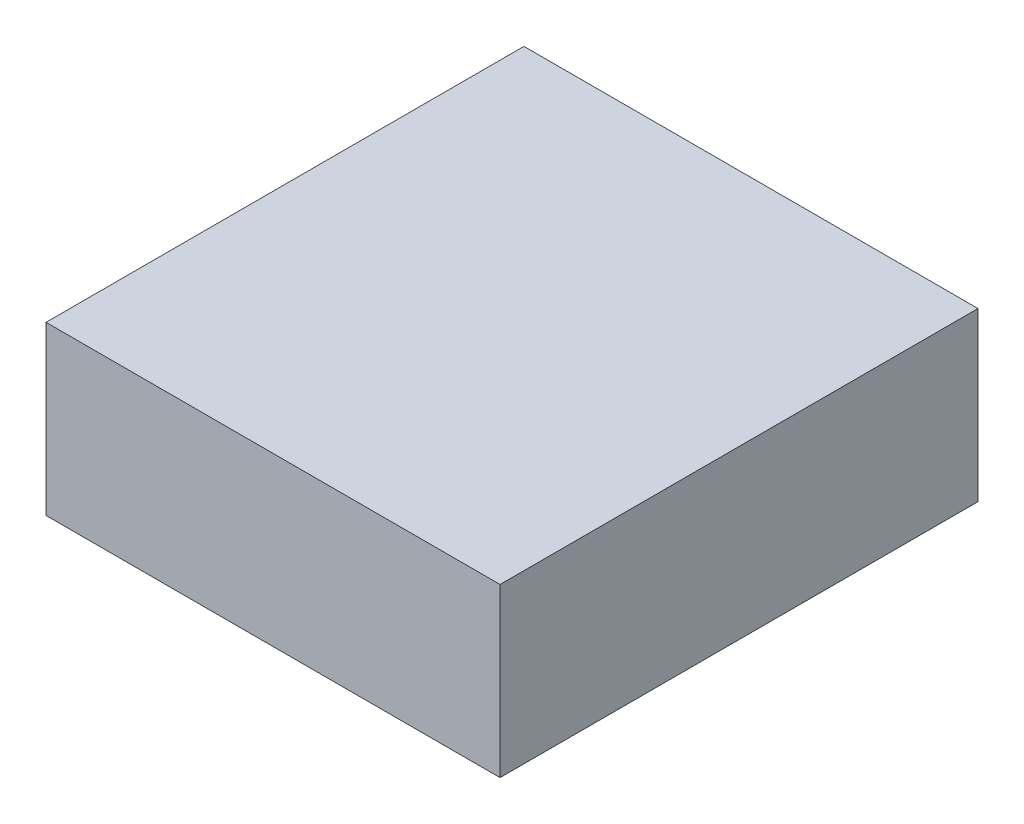
ISO-10303-21;
HEADER;
FILE_DESCRIPTION(('STEP AP214'),'2;1');
FILE_NAME('part.step','',(''),(''),'','','');
FILE_SCHEMA(('AUTOMOTIVE_DESIGN { 1 0 10303 214 1 1 1 1 }'));
ENDSEC;
DATA;
#1=APPLICATION_CONTEXT('core data for automotive mechanical design processes');
#2=APPLICATION_PROTOCOL_DEFINITION('international standard','automotive_design',2000,#1);
#3=PRODUCT_CONTEXT('',#1,'mechanical');
#4=PRODUCT('Part','Part','',(#3));
#5=PRODUCT_RELATED_PRODUCT_CATEGORY('part','',(#4));
#6=PRODUCT_DEFINITION_FORMATION('','',#4);
#7=PRODUCT_DEFINITION_CONTEXT('part definition',#1,'design');
#8=PRODUCT_DEFINITION('design','',#6,#7);
#9=PRODUCT_DEFINITION_SHAPE('','',#8);
#10=(LENGTH_UNIT() NAMED_UNIT(*) SI_UNIT(.MILLI.,.METRE.));
#11=(NAMED_UNIT(*) PLANE_ANGLE_UNIT() SI_UNIT($,.RADIAN.));
#12=(NAMED_UNIT(*) SI_UNIT($,.STERADIAN.) SOLID_ANGLE_UNIT());
#13=UNCERTAINTY_MEASURE_WITH_UNIT(LENGTH_MEASURE(1.E-05),#10,'distance_accuracy_value','');
#14=(GEOMETRIC_REPRESENTATION_CONTEXT(3) GLOBAL_UNCERTAINTY_ASSIGNED_CONTEXT((#13)) GLOBAL_UNIT_ASSIGNED_CONTEXT((#10,
#11,#12)) REPRESENTATION_CONTEXT('',''));
#15=CARTESIAN_POINT('',(0.,0.,0.));
#16=DIRECTION('',(0.,0.,1.));
#17=DIRECTION('',(1.,0.,0.));
#18=AXIS2_PLACEMENT_3D('',#15,#16,#17);
#19=CARTESIAN_POINT('',(0.47500032,0.17500346,0.));
#20=DIRECTION('',(2.67368956969514E-06,-0.999999999996426,0.));
#21=DIRECTION('',(-0.999999999996426,-2.67368956969514E-06,0.));
#22=AXIS2_PLACEMENT_3D('',#19,#20,#21);
#23=PLANE('',#22);
#24=DIRECTION('',(-0.999999999996426,-2.67368956969514E-06,0.));
#25=VECTOR('',#24,1.);
#26=CARTESIAN_POINT('',(0.47500032,0.17500346,0.));
#27=LINE('',#26,#25);
#28=CARTESIAN_POINT('',(0.47500032,0.17500346,0.));
#29=VERTEX_POINT('',#28);
#30=CARTESIAN_POINT('',(-0.47499778,0.17500092,0.));
#31=VERTEX_POINT('',#30);
#32=EDGE_CURVE('E11',#29,#31,#27,.T.);
#33=ORIENTED_EDGE('',*,*,#32,.T.);
#34=DIRECTION('',(0.,0.,1.));
#35=VECTOR('',#34,1.);
#36=CARTESIAN_POINT('',(-0.47499778,0.17500092,0.));
#37=LINE('',#36,#35);
#38=CARTESIAN_POINT('',(-0.47499778,0.17500092,1.00000054));
#39=VERTEX_POINT('',#38);
#40=EDGE_CURVE('E23',#31,#39,#37,.T.);
#41=ORIENTED_EDGE('',*,*,#40,.T.);
#42=DIRECTION('',(-0.999999999996426,-2.67368956969514E-06,0.));
#43=VECTOR('',#42,1.);
#44=CARTESIAN_POINT('',(0.47500032,0.17500346,1.00000054));
#45=LINE('',#44,#43);
#46=CARTESIAN_POINT('',(0.47500032,0.17500346,1.00000054));
#47=VERTEX_POINT('',#46);
#48=EDGE_CURVE('E86',#47,#39,#45,.T.);
#49=ORIENTED_EDGE('',*,*,#48,.F.);
#50=DIRECTION('',(0.,0.,1.));
#51=VECTOR('',#50,1.);
#52=CARTESIAN_POINT('',(0.47500032,0.17500346,0.));
#53=LINE('',#52,#51);
#54=EDGE_CURVE('E35',#29,#47,#53,.T.);
#55=ORIENTED_EDGE('',*,*,#54,.F.);
#56=EDGE_LOOP('',(#33,#41,#49,#55));
#57=FACE_BOUND('',#56,.T.);
#58=ADVANCED_FACE('F16',(#57),#23,.F.);
#59=CARTESIAN_POINT('',(-0.47499778,0.17500092,0.));
#60=DIRECTION('',(1.,0.,0.));
#61=DIRECTION('',(0.,-1.,0.));
#62=AXIS2_PLACEMENT_3D('',#59,#60,#61);
#63=PLANE('',#62);
#64=DIRECTION('',(0.,-1.,0.));
#65=VECTOR('',#64,1.);
#66=CARTESIAN_POINT('',(-0.47499778,0.17500092,0.));
#67=LINE('',#66,#65);
#68=CARTESIAN_POINT('',(-0.47499778,-0.17499838,0.));
#69=VERTEX_POINT('',#68);
#70=EDGE_CURVE('E83',#31,#69,#67,.T.);
#71=ORIENTED_EDGE('',*,*,#70,.T.);
#72=DIRECTION('',(0.,0.,1.));
#73=VECTOR('',#72,1.);
#74=CARTESIAN_POINT('',(-0.47499778,-0.17499838,0.));
#75=LINE('',#74,#73);
#76=CARTESIAN_POINT('',(-0.47499778,-0.17499838,1.00000054));
#77=VERTEX_POINT('',#76);
#78=EDGE_CURVE('E81',#69,#77,#75,.T.);
#79=ORIENTED_EDGE('',*,*,#78,.T.);
#80=DIRECTION('',(0.,-1.,0.));
#81=VECTOR('',#80,1.);
#82=CARTESIAN_POINT('',(-0.47499778,0.17500092,1.00000054));
#83=LINE('',#82,#81);
#84=EDGE_CURVE('E61',#39,#77,#83,.T.);
#85=ORIENTED_EDGE('',*,*,#84,.F.);
#86=ORIENTED_EDGE('',*,*,#40,.F.);
#87=EDGE_LOOP('',(#71,#79,#85,#86));
#88=FACE_BOUND('',#87,.T.);
#89=ADVANCED_FACE('F88',(#88),#63,.F.);
#90=CARTESIAN_POINT('',(-0.47499778,-0.17499838,0.));
#91=DIRECTION('',(2.67368955473714E-06,0.999999999996426,0.));
#92=DIRECTION('',(0.999999999996426,-2.67368955473714E-06,0.));
#93=AXIS2_PLACEMENT_3D('',#90,#91,#92);
#94=PLANE('',#93);
#95=DIRECTION('',(0.999999999996426,-2.67368955473714E-06,0.));
#96=VECTOR('',#95,1.);
#97=CARTESIAN_POINT('',(-0.47499778,-0.17499838,0.));
#98=LINE('',#97,#96);
#99=CARTESIAN_POINT('',(0.47500032,-0.17500092,0.));
#100=VERTEX_POINT('',#99);
#101=EDGE_CURVE('E70',#69,#100,#98,.T.);
#102=ORIENTED_EDGE('',*,*,#101,.T.);
#103=DIRECTION('',(0.,0.,1.));
#104=VECTOR('',#103,1.);
#105=CARTESIAN_POINT('',(0.47500032,-0.17500092,0.));
#106=LINE('',#105,#104);
#107=CARTESIAN_POINT('',(0.47500032,-0.17500092,1.00000054));
#108=VERTEX_POINT('',#107);
#109=EDGE_CURVE('E64',#100,#108,#106,.T.);
#110=ORIENTED_EDGE('',*,*,#109,.T.);
#111=DIRECTION('',(0.999999999996426,-2.67368955473714E-06,0.));
#112=VECTOR('',#111,1.);
#113=CARTESIAN_POINT('',(-0.47499778,-0.17499838,1.00000054));
#114=LINE('',#113,#112);
#115=EDGE_CURVE('E56',#77,#108,#114,.T.);
#116=ORIENTED_EDGE('',*,*,#115,.F.);
#117=ORIENTED_EDGE('',*,*,#78,.F.);
#118=EDGE_LOOP('',(#102,#110,#116,#117));
#119=FACE_BOUND('',#118,.T.);
#120=ADVANCED_FACE('F68',(#119),#94,.F.);
#121=CARTESIAN_POINT('',(0.47500032,-0.17500092,0.));
#122=DIRECTION('',(-1.,0.,0.));
#123=DIRECTION('',(0.,1.,0.));
#124=AXIS2_PLACEMENT_3D('',#121,#122,#123);
#125=PLANE('',#124);
#126=DIRECTION('',(0.,1.,0.));
#127=VECTOR('',#126,1.);
#128=CARTESIAN_POINT('',(0.47500032,-0.17500092,0.));
#129=LINE('',#128,#127);
#130=EDGE_CURVE('E65',#100,#29,#129,.T.);
#131=ORIENTED_EDGE('',*,*,#130,.T.);
#132=ORIENTED_EDGE('',*,*,#54,.T.);
#133=DIRECTION('',(0.,1.,0.));
#134=VECTOR('',#133,1.);
#135=CARTESIAN_POINT('',(0.47500032,-0.17500092,1.00000054));
#136=LINE('',#135,#134);
#137=EDGE_CURVE('E60',#108,#47,#136,.T.);
#138=ORIENTED_EDGE('',*,*,#137,.F.);
#139=ORIENTED_EDGE('',*,*,#109,.F.);
#140=EDGE_LOOP('',(#131,#132,#138,#139));
#141=FACE_BOUND('',#140,.T.);
#142=ADVANCED_FACE('F75',(#141),#125,.F.);
#143=CARTESIAN_POINT('',(0.47500032,0.17500346,0.));
#144=DIRECTION('',(0.,0.,-1.));
#145=DIRECTION('',(-1.,0.,0.));
#146=AXIS2_PLACEMENT_3D('',#143,#144,#145);
#147=PLANE('',#146);
#148=ORIENTED_EDGE('',*,*,#130,.F.);
#149=ORIENTED_EDGE('',*,*,#101,.F.);
#150=ORIENTED_EDGE('',*,*,#70,.F.);
#151=ORIENTED_EDGE('',*,*,#32,.F.);
#152=EDGE_LOOP('',(#148,#149,#150,#151));
#153=FACE_BOUND('',#152,.T.);
#154=ADVANCED_FACE('F90',(#153),#147,.T.);
#155=CARTESIAN_POINT('',(0.47500032,0.17500346,1.00000054));
#156=DIRECTION('',(0.,0.,-1.));
#157=DIRECTION('',(-1.,0.,0.));
#158=AXIS2_PLACEMENT_3D('',#155,#156,#157);
#159=PLANE('',#158);
#160=ORIENTED_EDGE('',*,*,#48,.T.);
#161=ORIENTED_EDGE('',*,*,#84,.T.);
#162=ORIENTED_EDGE('',*,*,#115,.T.);
#163=ORIENTED_EDGE('',*,*,#137,.T.);
#164=EDGE_LOOP('',(#160,#161,#162,#163));
#165=FACE_BOUND('',#164,.T.);
#166=ADVANCED_FACE('F58',(#165),#159,.F.);
#167=CLOSED_SHELL('',(#58,#89,#120,#142,#154,#166));
#168=MANIFOLD_SOLID_BREP('B1',#167);
#169=ADVANCED_BREP_SHAPE_REPRESENTATION('',(#18,#168),#14);
#170=SHAPE_DEFINITION_REPRESENTATION(#9,#169);
ENDSEC;
END-ISO-10303-21;
